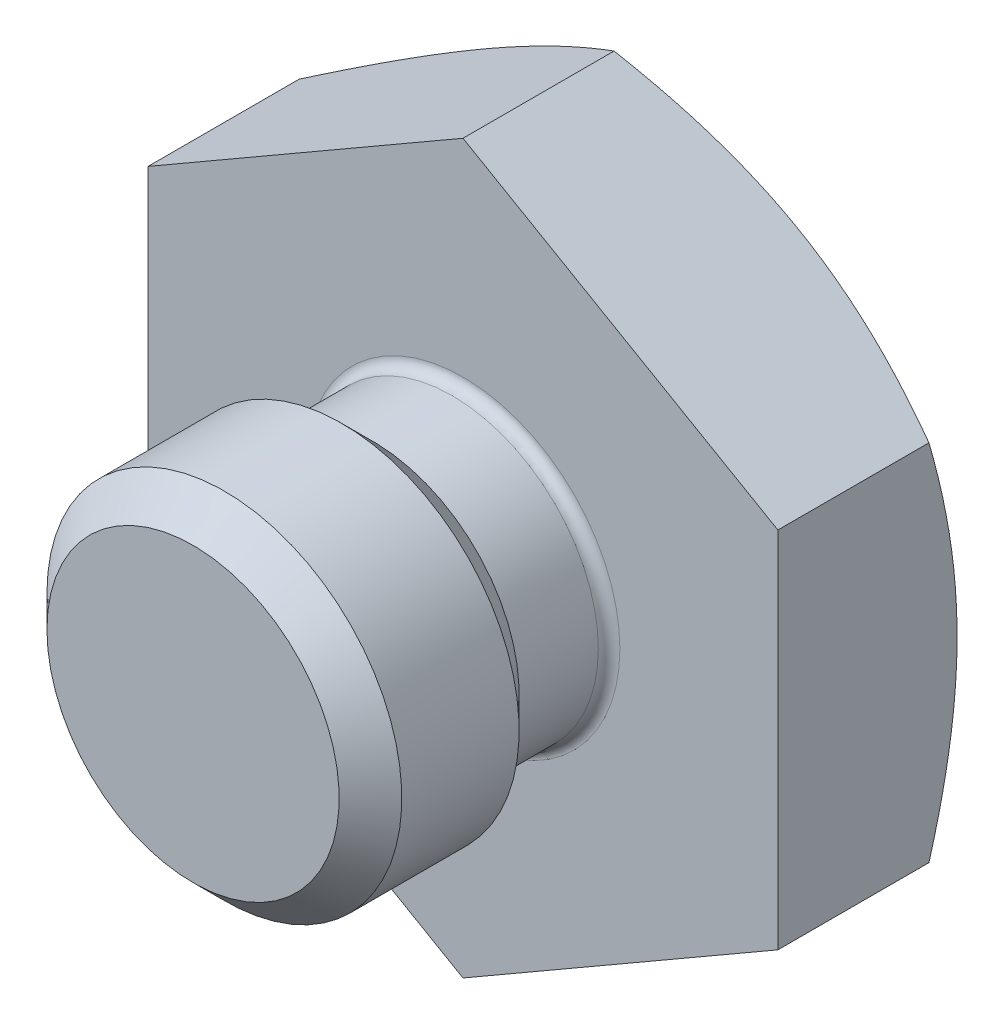
ISO-10303-21;
HEADER;
FILE_DESCRIPTION(('STEP AP214'),'2;1');
FILE_NAME('part.step','',(''),(''),'','','');
FILE_SCHEMA(('AUTOMOTIVE_DESIGN { 1 0 10303 214 1 1 1 1 }'));
ENDSEC;
DATA;
#1=APPLICATION_CONTEXT('core data for automotive mechanical design processes');
#2=APPLICATION_PROTOCOL_DEFINITION('international standard','automotive_design',2000,#1);
#3=PRODUCT_CONTEXT('',#1,'mechanical');
#4=PRODUCT('Part','Part','',(#3));
#5=PRODUCT_RELATED_PRODUCT_CATEGORY('part','',(#4));
#6=PRODUCT_DEFINITION_FORMATION('','',#4);
#7=PRODUCT_DEFINITION_CONTEXT('part definition',#1,'design');
#8=PRODUCT_DEFINITION('design','',#6,#7);
#9=PRODUCT_DEFINITION_SHAPE('','',#8);
#10=(LENGTH_UNIT() NAMED_UNIT(*) SI_UNIT(.MILLI.,.METRE.));
#11=(NAMED_UNIT(*) PLANE_ANGLE_UNIT() SI_UNIT($,.RADIAN.));
#12=(NAMED_UNIT(*) SI_UNIT($,.STERADIAN.) SOLID_ANGLE_UNIT());
#13=UNCERTAINTY_MEASURE_WITH_UNIT(LENGTH_MEASURE(1.E-05),#10,'distance_accuracy_value','');
#14=(GEOMETRIC_REPRESENTATION_CONTEXT(3) GLOBAL_UNCERTAINTY_ASSIGNED_CONTEXT((#13)) GLOBAL_UNIT_ASSIGNED_CONTEXT((#10,
#11,#12)) REPRESENTATION_CONTEXT('',''));
#15=CARTESIAN_POINT('',(0.,0.,0.));
#16=DIRECTION('',(0.,0.,1.));
#17=DIRECTION('',(1.,0.,0.));
#18=AXIS2_PLACEMENT_3D('',#15,#16,#17);
#19=CARTESIAN_POINT('',(0.,22.0651043510024,0.));
#20=DIRECTION('',(0.,0.,1.));
#21=DIRECTION('',(1.,0.,0.));
#22=AXIS2_PLACEMENT_3D('',#19,#20,#21);
#23=PLANE('',#22);
#24=CARTESIAN_POINT('',(0.,0.,0.));
#25=DIRECTION('',(0.,0.,1.));
#26=DIRECTION('',(1.,0.,0.));
#27=AXIS2_PLACEMENT_3D('',#24,#25,#26);
#28=CIRCLE('',#27,5.5372);
#29=CARTESIAN_POINT('',(5.5372,0.,0.));
#30=VERTEX_POINT('',#29);
#31=EDGE_CURVE('E42',#30,#30,#28,.F.);
#32=ORIENTED_EDGE('',*,*,#31,.T.);
#33=EDGE_LOOP('',(#32));
#34=FACE_BOUND('',#33,.T.);
#35=DIRECTION('',(0.,1.,0.));
#36=VECTOR('',#35,1.);
#37=CARTESIAN_POINT('',(11.1125,-6.41580486636972,0.));
#38=LINE('',#37,#36);
#39=CARTESIAN_POINT('',(11.1125,-6.41580486636972,0.));
#40=VERTEX_POINT('',#39);
#41=CARTESIAN_POINT('',(11.1125,6.41580486636972,0.));
#42=VERTEX_POINT('',#41);
#43=EDGE_CURVE('E115',#40,#42,#38,.T.);
#44=ORIENTED_EDGE('',*,*,#43,.T.);
#45=DIRECTION('',(-0.866025403784439,0.5,0.));
#46=VECTOR('',#45,1.);
#47=CARTESIAN_POINT('',(11.1125,6.41580486636972,0.));
#48=LINE('',#47,#46);
#49=CARTESIAN_POINT('',(0.,12.8316097327394,0.));
#50=VERTEX_POINT('',#49);
#51=EDGE_CURVE('E110',#42,#50,#48,.T.);
#52=ORIENTED_EDGE('',*,*,#51,.T.);
#53=DIRECTION('',(-0.866025403784439,-0.5,0.));
#54=VECTOR('',#53,1.);
#55=CARTESIAN_POINT('',(0.,12.8316097327394,0.));
#56=LINE('',#55,#54);
#57=CARTESIAN_POINT('',(-11.1125,6.41580486636972,0.));
#58=VERTEX_POINT('',#57);
#59=EDGE_CURVE('E108',#50,#58,#56,.T.);
#60=ORIENTED_EDGE('',*,*,#59,.T.);
#61=DIRECTION('',(0.,-1.,0.));
#62=VECTOR('',#61,1.);
#63=CARTESIAN_POINT('',(-11.1125,6.41580486636972,0.));
#64=LINE('',#63,#62);
#65=CARTESIAN_POINT('',(-11.1125,-6.41580486636972,0.));
#66=VERTEX_POINT('',#65);
#67=EDGE_CURVE('E57',#58,#66,#64,.T.);
#68=ORIENTED_EDGE('',*,*,#67,.T.);
#69=DIRECTION('',(0.866025403784439,-0.5,0.));
#70=VECTOR('',#69,1.);
#71=CARTESIAN_POINT('',(-11.1125,-6.41580486636972,0.));
#72=LINE('',#71,#70);
#73=CARTESIAN_POINT('',(0.,-12.8316097327394,0.));
#74=VERTEX_POINT('',#73);
#75=EDGE_CURVE('E97',#66,#74,#72,.T.);
#76=ORIENTED_EDGE('',*,*,#75,.T.);
#77=DIRECTION('',(0.866025403784439,0.5,0.));
#78=VECTOR('',#77,1.);
#79=CARTESIAN_POINT('',(0.,-12.8316097327394,0.));
#80=LINE('',#79,#78);
#81=EDGE_CURVE('E103',#74,#40,#80,.T.);
#82=ORIENTED_EDGE('',*,*,#81,.T.);
#83=EDGE_LOOP('',(#44,#52,#60,#68,#76,#82));
#84=FACE_BOUND('',#83,.T.);
#85=ADVANCED_FACE('F34',(#34,#84),#23,.T.);
#86=CARTESIAN_POINT('',(0.,0.,0.));
#87=DIRECTION('',(0.,0.,-1.));
#88=DIRECTION('',(-1.,0.,0.));
#89=AXIS2_PLACEMENT_3D('',#86,#87,#88);
#90=CYLINDRICAL_SURFACE('',#89,5.1562);
#91=CARTESIAN_POINT('',(0.,0.,0.380999999999999));
#92=DIRECTION('',(0.,0.,1.));
#93=DIRECTION('',(1.,0.,0.));
#94=AXIS2_PLACEMENT_3D('',#91,#92,#93);
#95=CIRCLE('',#94,5.1562);
#96=CARTESIAN_POINT('',(5.1562,0.,0.380999999999999));
#97=VERTEX_POINT('',#96);
#98=EDGE_CURVE('E12',#97,#97,#95,.T.);
#99=ORIENTED_EDGE('',*,*,#98,.T.);
#100=EDGE_LOOP('',(#99));
#101=FACE_BOUND('',#100,.T.);
#102=CARTESIAN_POINT('',(0.,0.,3.175));
#103=DIRECTION('',(0.,0.,-1.));
#104=DIRECTION('',(-1.,0.,0.));
#105=AXIS2_PLACEMENT_3D('',#102,#103,#104);
#106=CIRCLE('',#105,5.1562);
#107=CARTESIAN_POINT('',(-5.1562,0.,3.175));
#108=VERTEX_POINT('',#107);
#109=EDGE_CURVE('E180',#108,#108,#106,.T.);
#110=ORIENTED_EDGE('',*,*,#109,.T.);
#111=EDGE_LOOP('',(#110));
#112=FACE_BOUND('',#111,.T.);
#113=ADVANCED_FACE('F194',(#101,#112),#90,.T.);
#114=CARTESIAN_POINT('',(0.,0.,3.175));
#115=DIRECTION('',(0.,0.,1.));
#116=DIRECTION('',(1.,0.,0.));
#117=AXIS2_PLACEMENT_3D('',#114,#115,#116);
#118=CONICAL_SURFACE('',#117,5.1562,0.785398163397446);
#119=CARTESIAN_POINT('',(0.,0.,4.2799));
#120=DIRECTION('',(0.,0.,-1.));
#121=DIRECTION('',(-1.,0.,0.));
#122=AXIS2_PLACEMENT_3D('',#119,#120,#121);
#123=CIRCLE('',#122,6.2611);
#124=CARTESIAN_POINT('',(-6.2611,0.,4.2799));
#125=VERTEX_POINT('',#124);
#126=EDGE_CURVE('E177',#125,#125,#123,.T.);
#127=ORIENTED_EDGE('',*,*,#126,.T.);
#128=EDGE_LOOP('',(#127));
#129=FACE_BOUND('',#128,.T.);
#130=ORIENTED_EDGE('',*,*,#109,.F.);
#131=EDGE_LOOP('',(#130));
#132=FACE_BOUND('',#131,.T.);
#133=ADVANCED_FACE('F198',(#129,#132),#118,.T.);
#134=CARTESIAN_POINT('',(0.,0.,0.));
#135=DIRECTION('',(0.,0.,-1.));
#136=DIRECTION('',(-1.,0.,0.));
#137=AXIS2_PLACEMENT_3D('',#134,#135,#136);
#138=CYLINDRICAL_SURFACE('',#137,6.2611);
#139=CARTESIAN_POINT('',(0.,0.,8.42010000000001));
#140=DIRECTION('',(0.,0.,-1.));
#141=DIRECTION('',(-1.,0.,0.));
#142=AXIS2_PLACEMENT_3D('',#139,#140,#141);
#143=CIRCLE('',#142,6.2611);
#144=CARTESIAN_POINT('',(-6.2611,0.,8.42010000000001));
#145=VERTEX_POINT('',#144);
#146=EDGE_CURVE('E174',#145,#145,#143,.T.);
#147=ORIENTED_EDGE('',*,*,#146,.T.);
#148=EDGE_LOOP('',(#147));
#149=FACE_BOUND('',#148,.T.);
#150=ORIENTED_EDGE('',*,*,#126,.F.);
#151=EDGE_LOOP('',(#150));
#152=FACE_BOUND('',#151,.T.);
#153=ADVANCED_FACE('F204',(#149,#152),#138,.T.);
#154=CARTESIAN_POINT('',(0.,0.,8.42010000000001));
#155=DIRECTION('',(0.,0.,-1.));
#156=DIRECTION('',(-1.,0.,0.));
#157=AXIS2_PLACEMENT_3D('',#154,#155,#156);
#158=CONICAL_SURFACE('',#157,6.2611,0.785398163397451);
#159=CARTESIAN_POINT('',(0.,0.,9.525));
#160=DIRECTION('',(0.,0.,-1.));
#161=DIRECTION('',(-1.,0.,0.));
#162=AXIS2_PLACEMENT_3D('',#159,#160,#161);
#163=CIRCLE('',#162,5.1562);
#164=CARTESIAN_POINT('',(-5.1562,0.,9.525));
#165=VERTEX_POINT('',#164);
#166=EDGE_CURVE('E171',#165,#165,#163,.T.);
#167=ORIENTED_EDGE('',*,*,#166,.T.);
#168=EDGE_LOOP('',(#167));
#169=FACE_BOUND('',#168,.T.);
#170=ORIENTED_EDGE('',*,*,#146,.F.);
#171=EDGE_LOOP('',(#170));
#172=FACE_BOUND('',#171,.T.);
#173=ADVANCED_FACE('F208',(#169,#172),#158,.T.);
#174=CARTESIAN_POINT('',(0.,5.1562,9.525));
#175=DIRECTION('',(0.,0.,1.));
#176=DIRECTION('',(1.,0.,0.));
#177=AXIS2_PLACEMENT_3D('',#174,#175,#176);
#178=PLANE('',#177);
#179=ORIENTED_EDGE('',*,*,#166,.F.);
#180=EDGE_LOOP('',(#179));
#181=FACE_BOUND('',#180,.T.);
#182=ADVANCED_FACE('F151',(#181),#178,.T.);
#183=CARTESIAN_POINT('',(11.1125,6.41580486636972,-12.7));
#184=DIRECTION('',(0.5,0.866025403784439,0.));
#185=DIRECTION('',(-0.866025403784439,0.5,0.));
#186=AXIS2_PLACEMENT_3D('',#183,#184,#185);
#187=PLANE('',#186);
#188=DIRECTION('',(0.,0.,1.));
#189=VECTOR('',#188,1.);
#190=CARTESIAN_POINT('',(0.,12.8316097327394,-12.7));
#191=LINE('',#190,#189);
#192=CARTESIAN_POINT('',(0.,12.8316097327394,-5.33096060341504));
#193=VERTEX_POINT('',#192);
#194=EDGE_CURVE('E49',#193,#50,#191,.T.);
#195=ORIENTED_EDGE('',*,*,#194,.T.);
#196=ORIENTED_EDGE('',*,*,#51,.F.);
#197=DIRECTION('',(0.,0.,1.));
#198=VECTOR('',#197,1.);
#199=CARTESIAN_POINT('',(11.1125,6.41580486636972,-12.7));
#200=LINE('',#199,#198);
#201=CARTESIAN_POINT('',(11.1125,6.41580486636972,-5.33096060341504));
#202=VERTEX_POINT('',#201);
#203=EDGE_CURVE('E117',#202,#42,#200,.T.);
#204=ORIENTED_EDGE('',*,*,#203,.F.);
#205=CARTESIAN_POINT('',(-0.000199999999999041,12.8317252027933,-5.33089393584849));
#206=CARTESIAN_POINT('',(0.244076762021835,12.6906919484832,-5.41230598639815));
#207=CARTESIAN_POINT('',(0.489264313393952,12.5491328496966,-5.49002297782529));
#208=CARTESIAN_POINT('',(0.981605635632657,12.2648794547689,-5.63704157481002));
#209=CARTESIAN_POINT('',(1.22876002486926,12.1221848016117,-5.70634041256519));
#210=CARTESIAN_POINT('',(1.97420558123972,11.691801608975,-5.90026858248958));
#211=CARTESIAN_POINT('',(2.47543949233606,11.4024140754766,-6.01057385305758));
#212=CARTESIAN_POINT('',(3.22551305858847,10.9693589000887,-6.13991679700567));
#213=CARTESIAN_POINT('',(3.47211185206991,10.8269850202904,-6.17676168676763));
#214=CARTESIAN_POINT('',(3.96645121493752,10.5415780560677,-6.23854803187426));
#215=CARTESIAN_POINT('',(4.21419180620731,10.3985449590089,-6.26348925810822));
#216=CARTESIAN_POINT('',(4.71008602486758,10.1122402983758,-6.30082942022814));
#217=CARTESIAN_POINT('',(4.95823880876392,9.96896922179313,-6.31324326050465));
#218=CARTESIAN_POINT('',(5.45477431983529,9.68229431081387,-6.32526412462837));
#219=CARTESIAN_POINT('',(5.70315703966859,9.53889048065606,-6.32487154417028));
#220=CARTESIAN_POINT('',(6.16750984478556,9.27079626362282,-6.31217328038341));
#221=CARTESIAN_POINT('',(6.3835130443655,9.14608675819952,-6.30141650643445));
#222=CARTESIAN_POINT('',(6.81502263931866,8.89695457739541,-6.27042009971527));
#223=CARTESIAN_POINT('',(7.03052899846601,8.77253192292961,-6.25017979616281));
#224=CARTESIAN_POINT('',(7.46092779430608,8.52404106229246,-6.20056920621003));
#225=CARTESIAN_POINT('',(7.67581957542821,8.39997323461496,-6.171191378792));
#226=CARTESIAN_POINT('',(8.10459567090841,8.15241924046738,-6.10382119618171));
#227=CARTESIAN_POINT('',(8.31847991577917,8.02893311411583,-6.0658282554544));
#228=CARTESIAN_POINT('',(8.96773759978886,7.6540840154794,-5.93796633362871));
#229=CARTESIAN_POINT('',(9.40123086045864,7.40380656473982,-5.8353480010402));
#230=CARTESIAN_POINT('',(10.2617533370355,6.90698368124445,-5.60244613814769));
#231=CARTESIAN_POINT('',(10.6887935711641,6.66043188711547,-5.47221730835082));
#232=CARTESIAN_POINT('',(11.1127,6.41568939631588,-5.33089393584849));
#233=B_SPLINE_CURVE_WITH_KNOTS('',3,(#205,#206,#207,#208,#209,#210,#211,#212,#213,#214,#215,
#216,#217,#218,#219,#220,#221,#222,#223,#224,#225,#226,#227,#228,#229,#230,#231,#232),
.UNSPECIFIED.,.F.,.F.,(4,2,2,2,2,2,2,2,2,2,2,2,2,4),(0.,0.880670721261017,1.76163021875584,
3.52729939564295,4.38846390154098,5.24964498166892,6.10980026395483,6.96992896905975,
7.71870115413392,8.46752630882554,9.21697110123334,9.96646684570254,11.4984186964915,
13.0273634187077),.UNSPECIFIED.);
#234=EDGE_CURVE('E155',#193,#202,#233,.T.);
#235=ORIENTED_EDGE('',*,*,#234,.F.);
#236=EDGE_LOOP('',(#195,#196,#204,#235));
#237=FACE_BOUND('',#236,.T.);
#238=ADVANCED_FACE('F146',(#237),#187,.T.);
#239=CARTESIAN_POINT('',(11.1125,-6.41580486636972,-12.7));
#240=DIRECTION('',(1.,0.,0.));
#241=DIRECTION('',(0.,0.,-1.));
#242=AXIS2_PLACEMENT_3D('',#239,#240,#241);
#243=PLANE('',#242);
#244=ORIENTED_EDGE('',*,*,#203,.T.);
#245=ORIENTED_EDGE('',*,*,#43,.F.);
#246=DIRECTION('',(0.,0.,1.));
#247=VECTOR('',#246,1.);
#248=CARTESIAN_POINT('',(11.1125,-6.41580486636972,-12.7));
#249=LINE('',#248,#247);
#250=CARTESIAN_POINT('',(11.1125,-6.41580486636972,-5.33096060341504));
#251=VERTEX_POINT('',#250);
#252=EDGE_CURVE('E120',#251,#40,#249,.T.);
#253=ORIENTED_EDGE('',*,*,#252,.F.);
#254=CARTESIAN_POINT('',(11.1125,-17.3163808550814,-0.86011464174898));
#255=CARTESIAN_POINT('',(11.1125,-17.0732831474879,-0.978234188057745));
#256=CARTESIAN_POINT('',(11.1125,-16.8299023133235,-1.09577076662881));
#257=CARTESIAN_POINT('',(11.1125,-16.3425153146138,-1.32954607156344));
#258=CARTESIAN_POINT('',(11.1125,-16.0985091439224,-1.44578478511017));
#259=CARTESIAN_POINT('',(11.1125,-15.3654000608585,-1.79238640754345));
#260=CARTESIAN_POINT('',(11.1125,-14.8752773335228,-2.0206003247272));
#261=CARTESIAN_POINT('',(11.1125,-13.8891520054796,-2.47114232554079));
#262=CARTESIAN_POINT('',(11.1125,-13.3931319727371,-2.69343234514444));
#263=CARTESIAN_POINT('',(11.1125,-12.3971742596451,-3.12902399514797));
#264=CARTESIAN_POINT('',(11.1125,-11.8972367636722,-3.34232604559143));
#265=CARTESIAN_POINT('',(11.1125,-10.8765224111345,-3.76423055937271));
#266=CARTESIAN_POINT('',(11.1125,-10.3555916363179,-3.97246256598276));
#267=CARTESIAN_POINT('',(11.1125,-9.30766357441253,-4.37336691443061));
#268=CARTESIAN_POINT('',(11.1125,-8.78066561909573,-4.566037523266));
#269=CARTESIAN_POINT('',(11.1125,-7.72073996957428,-4.9308210859016));
#270=CARTESIAN_POINT('',(11.1125,-7.18782643720066,-5.10297486193236));
#271=CARTESIAN_POINT('',(11.1125,-6.11430720962286,-5.42126710583382));
#272=CARTESIAN_POINT('',(11.1125,-5.57370396599905,-5.56741367291428));
#273=CARTESIAN_POINT('',(11.1125,-4.7583463695225,-5.76150299576198));
#274=CARTESIAN_POINT('',(11.1125,-4.48653579470749,-5.82188548215318));
#275=CARTESIAN_POINT('',(11.1125,-3.94104211388288,-5.93355048898954));
#276=CARTESIAN_POINT('',(11.1125,-3.66735904567324,-5.98483319257206));
#277=CARTESIAN_POINT('',(11.1125,-3.11830510525835,-6.0773982101618));
#278=CARTESIAN_POINT('',(11.1125,-2.84293427353903,-6.11868076309662));
#279=CARTESIAN_POINT('',(11.1125,-2.29078777789797,-6.19042563364328));
#280=CARTESIAN_POINT('',(11.1125,-2.01401216977862,-6.2208883776943));
#281=CARTESIAN_POINT('',(11.1125,-1.4630936010086,-6.27000177646034));
#282=CARTESIAN_POINT('',(11.1125,-1.18896415966425,-6.28880314853497));
#283=CARTESIAN_POINT('',(11.1125,-0.640156165528436,-6.31479208853917));
#284=CARTESIAN_POINT('',(11.1125,-0.36547762206685,-6.32197985214618));
#285=CARTESIAN_POINT('',(11.1125,0.183942547843022,-6.3245702514621));
#286=CARTESIAN_POINT('',(11.1125,0.45868417542157,-6.31997265632487));
#287=CARTESIAN_POINT('',(11.1125,1.00772685757231,-6.29910529502289));
#288=CARTESIAN_POINT('',(11.1125,1.28202789053898,-6.28283497297929));
#289=CARTESIAN_POINT('',(11.1125,1.93850005283681,-6.23027423297106));
#290=CARTESIAN_POINT('',(11.1125,2.32024937636801,-6.18859928722155));
#291=CARTESIAN_POINT('',(11.1125,3.08095305469322,-6.08489345026863));
#292=CARTESIAN_POINT('',(11.1125,3.4599070350272,-6.02285988072812));
#293=CARTESIAN_POINT('',(11.1125,4.59209625060347,-5.80950844564311));
#294=CARTESIAN_POINT('',(11.1125,5.34027287668224,-5.63097486906531));
#295=CARTESIAN_POINT('',(11.1125,6.45963309143137,-5.32076231528335));
#296=CARTESIAN_POINT('',(11.1125,6.83659788523786,-5.20874134917319));
#297=CARTESIAN_POINT('',(11.1125,7.58686493407525,-4.97293066199331));
#298=CARTESIAN_POINT('',(11.1125,7.96016716004741,-4.84914084763294));
#299=CARTESIAN_POINT('',(11.1125,8.7032315769044,-4.59178840133819));
#300=CARTESIAN_POINT('',(11.1125,9.07299478553518,-4.45822868072591));
#301=CARTESIAN_POINT('',(11.1125,9.80944455189089,-4.18292925909557));
#302=CARTESIAN_POINT('',(11.1125,10.1761311917065,-4.04118977713451));
#303=CARTESIAN_POINT('',(11.1125,10.8770185909319,-3.76269608550133));
#304=CARTESIAN_POINT('',(11.1125,11.2114324984845,-3.62647626593185));
#305=CARTESIAN_POINT('',(11.1125,11.8782166722031,-3.3491161399066));
#306=CARTESIAN_POINT('',(11.1125,12.2105868978992,-3.20797573637798));
#307=CARTESIAN_POINT('',(11.1125,13.2050473108193,-2.77825367654655));
#308=CARTESIAN_POINT('',(11.1125,13.8644262156387,-2.48339572995478));
#309=CARTESIAN_POINT('',(11.1125,15.177772334415,-1.88121634572846));
#310=CARTESIAN_POINT('',(11.1125,15.8317370865141,-1.57388957695138));
#311=CARTESIAN_POINT('',(11.1125,17.1351542325189,-0.949912679069006));
#312=CARTESIAN_POINT('',(11.1125,17.7846068420358,-0.633262999296053));
#313=CARTESIAN_POINT('',(11.1125,19.0810712253211,0.00776912803546464));
#314=CARTESIAN_POINT('',(11.1125,19.7280768479566,0.332163983963949));
#315=CARTESIAN_POINT('',(11.1125,21.0192312519957,0.986597155662237));
#316=CARTESIAN_POINT('',(11.1125,21.6633800047825,1.31663552780229));
#317=CARTESIAN_POINT('',(11.1125,22.9491994310014,1.98111449897096));
#318=CARTESIAN_POINT('',(11.1125,23.5908706745962,2.31555399605806));
#319=CARTESIAN_POINT('',(11.1125,24.8723088530475,2.98805209019673));
#320=CARTESIAN_POINT('',(11.1125,25.5120757949708,3.32611067379645));
#321=CARTESIAN_POINT('',(11.1125,27.2834661272415,4.26735362520282));
#322=CARTESIAN_POINT('',(11.1125,28.4134154794286,4.87368769134571));
#323=CARTESIAN_POINT('',(11.1125,30.669809329253,6.09301713013968));
#324=CARTESIAN_POINT('',(11.1125,31.796253574387,6.70601296903109));
#325=CARTESIAN_POINT('',(11.1125,34.0425334369422,7.93478972391058));
#326=CARTESIAN_POINT('',(11.1125,35.1623784136073,8.55055354090201));
#327=CARTESIAN_POINT('',(11.1125,36.8405520575841,9.47697092510659));
#328=CARTESIAN_POINT('',(11.1125,37.3996539726158,9.78622549701891));
#329=CARTESIAN_POINT('',(11.1125,38.5173987127941,10.4055618320855));
#330=CARTESIAN_POINT('',(11.1125,39.076041538431,10.7156435943547));
#331=CARTESIAN_POINT('',(11.1125,39.634483563383,11.0260866520133));
#332=B_SPLINE_CURVE_WITH_KNOTS('',3,(#254,#255,#256,#257,#258,#259,#260,#261,#262,#263,#264,
#265,#266,#267,#268,#269,#270,#271,#272,#273,#274,#275,#276,#277,#278,#279,#280,#281,#282,#283,
#284,#285,#286,#287,#288,#289,#290,#291,#292,#293,#294,#295,#296,#297,#298,#299,#300,#301,#302,
#303,#304,#305,#306,#307,#308,#309,#310,#311,#312,#313,#314,#315,#316,#317,#318,#319,#320,#321,
#322,#323,#324,#325,#326,#327,#328,#329,#330,#331),.UNSPECIFIED.,.F.,.F.,(4,2,2,2,2,2,2,2,2,2,2,
2,2,2,2,2,2,2,2,2,2,2,2,2,2,2,2,2,2,2,2,2,2,2,2,2,2,2,4),(0.,0.81082437207601,1.6216567442356,
3.24355759731365,4.87414394743095,6.50465400904547,8.18748672449527,9.87050659173409,
11.5501197862313,13.2292089938113,14.0643916151135,14.8995574260695,15.7347032809421,
16.5698162167092,17.3938976494854,18.217965197185,19.0420488864608,19.8661718228729,
21.0175759114424,22.1691315370382,24.4733999702539,25.6530704591724,26.8327503000172,
28.0120800304364,29.1913781926162,30.2746142941394,31.3578717777545,33.52458400612,
35.6922325988175,37.8597768887595,40.0310639716323,42.2023727550863,44.3731478622347,
46.5439149035868,50.3909357462108,54.23822758843,58.0721399664524,59.988933682426,
61.9057253480588),.UNSPECIFIED.);
#333=EDGE_CURVE('E163',#202,#251,#332,.F.);
#334=ORIENTED_EDGE('',*,*,#333,.F.);
#335=EDGE_LOOP('',(#244,#245,#253,#334));
#336=FACE_BOUND('',#335,.T.);
#337=ADVANCED_FACE('F150',(#336),#243,.T.);
#338=CARTESIAN_POINT('',(0.,-12.8316097327394,-12.7));
#339=DIRECTION('',(0.5,-0.866025403784439,0.));
#340=DIRECTION('',(0.866025403784439,0.5,0.));
#341=AXIS2_PLACEMENT_3D('',#338,#339,#340);
#342=PLANE('',#341);
#343=ORIENTED_EDGE('',*,*,#252,.T.);
#344=ORIENTED_EDGE('',*,*,#81,.F.);
#345=DIRECTION('',(0.,0.,1.));
#346=VECTOR('',#345,1.);
#347=CARTESIAN_POINT('',(0.,-12.8316097327394,-12.7));
#348=LINE('',#347,#346);
#349=CARTESIAN_POINT('',(0.,-12.8316097327394,-5.33096060341504));
#350=VERTEX_POINT('',#349);
#351=EDGE_CURVE('E93',#350,#74,#348,.T.);
#352=ORIENTED_EDGE('',*,*,#351,.F.);
#353=CARTESIAN_POINT('',(11.1127,-6.41568939631589,-5.33089393584849));
#354=CARTESIAN_POINT('',(10.8684232379782,-6.55672265062596,-5.41230598639814));
#355=CARTESIAN_POINT('',(10.623235686606,-6.6982817494126,-5.49002297782529));
#356=CARTESIAN_POINT('',(10.1308943643673,-6.98253514434029,-5.63704157481002));
#357=CARTESIAN_POINT('',(9.88373997513074,-7.12522979749744,-5.70634041256518));
#358=CARTESIAN_POINT('',(9.13829441876028,-7.55561299013413,-5.90026858248958));
#359=CARTESIAN_POINT('',(8.63706050766394,-7.84500052363258,-6.01057385305757));
#360=CARTESIAN_POINT('',(7.88698694141154,-8.27805569902043,-6.13991679700566));
#361=CARTESIAN_POINT('',(7.64038814793009,-8.42042957881877,-6.17676168676762));
#362=CARTESIAN_POINT('',(7.14604878506248,-8.70583654304142,-6.23854803187425));
#363=CARTESIAN_POINT('',(6.89830819379269,-8.84886964010023,-6.26348925810821));
#364=CARTESIAN_POINT('',(6.40241397513242,-9.13517430073331,-6.30082942022814));
#365=CARTESIAN_POINT('',(6.15426119123608,-9.27844537731602,-6.31324326050465));
#366=CARTESIAN_POINT('',(5.65772568016471,-9.56512028829528,-6.32526412462837));
#367=CARTESIAN_POINT('',(5.40934296033141,-9.70852411845309,-6.32487154417027));
#368=CARTESIAN_POINT('',(4.94499015521444,-9.97661833548633,-6.31217328038341));
#369=CARTESIAN_POINT('',(4.7289869556345,-10.1013278409096,-6.30141650643444));
#370=CARTESIAN_POINT('',(4.29747736068134,-10.3504600217137,-6.27042009971527));
#371=CARTESIAN_POINT('',(4.08197100153399,-10.4748826761795,-6.25017979616281));
#372=CARTESIAN_POINT('',(3.65157220569392,-10.7233735368167,-6.20056920621003));
#373=CARTESIAN_POINT('',(3.43668042457179,-10.8474413644942,-6.171191378792));
#374=CARTESIAN_POINT('',(3.00790432909158,-11.0949953586418,-6.1038211961817));
#375=CARTESIAN_POINT('',(2.79402008422083,-11.2184814849933,-6.0658282554544));
#376=CARTESIAN_POINT('',(2.14476240021114,-11.5933305836297,-5.93796633362871));
#377=CARTESIAN_POINT('',(1.71126913954136,-11.8436080343693,-5.8353480010402));
#378=CARTESIAN_POINT('',(0.850746662964499,-12.3404309178647,-5.60244613814769));
#379=CARTESIAN_POINT('',(0.423706428835852,-12.5869827119937,-5.47221730835082));
#380=CARTESIAN_POINT('',(-0.000199999999999809,-12.8317252027933,-5.33089393584849));
#381=B_SPLINE_CURVE_WITH_KNOTS('',3,(#353,#354,#355,#356,#357,#358,#359,#360,#361,#362,#363,
#364,#365,#366,#367,#368,#369,#370,#371,#372,#373,#374,#375,#376,#377,#378,#379,#380),
.UNSPECIFIED.,.F.,.F.,(4,2,2,2,2,2,2,2,2,2,2,2,2,4),(0.,0.880670721261018,1.76163021875584,
3.52729939564295,4.38846390154098,5.24964498166892,6.10980026395483,6.96992896905975,
7.71870115413393,8.46752630882554,9.21697110123335,9.96646684570254,11.4984186964915,
13.0273634187077),.UNSPECIFIED.);
#382=EDGE_CURVE('E326',#251,#350,#381,.T.);
#383=ORIENTED_EDGE('',*,*,#382,.F.);
#384=EDGE_LOOP('',(#343,#344,#352,#383));
#385=FACE_BOUND('',#384,.T.);
#386=ADVANCED_FACE('F237',(#385),#342,.T.);
#387=CARTESIAN_POINT('',(-11.1125,-6.41580486636972,-12.7));
#388=DIRECTION('',(-0.5,-0.866025403784439,0.));
#389=DIRECTION('',(0.866025403784439,-0.5,0.));
#390=AXIS2_PLACEMENT_3D('',#387,#388,#389);
#391=PLANE('',#390);
#392=ORIENTED_EDGE('',*,*,#351,.T.);
#393=ORIENTED_EDGE('',*,*,#75,.F.);
#394=DIRECTION('',(0.,0.,1.));
#395=VECTOR('',#394,1.);
#396=CARTESIAN_POINT('',(-11.1125,-6.41580486636972,-12.7));
#397=LINE('',#396,#395);
#398=CARTESIAN_POINT('',(-11.1125,-6.41580486636972,-5.33096060341504));
#399=VERTEX_POINT('',#398);
#400=EDGE_CURVE('E86',#399,#66,#397,.T.);
#401=ORIENTED_EDGE('',*,*,#400,.F.);
#402=CARTESIAN_POINT('',(0.000200000000000615,-12.8317252027933,-5.33089393584849));
#403=CARTESIAN_POINT('',(-0.244076762021833,-12.6906919484832,-5.41230598639815));
#404=CARTESIAN_POINT('',(-0.48926431339395,-12.5491328496966,-5.49002297782529));
#405=CARTESIAN_POINT('',(-0.981605635632655,-12.2648794547689,-5.63704157481002));
#406=CARTESIAN_POINT('',(-1.22876002486926,-12.1221848016117,-5.70634041256518));
#407=CARTESIAN_POINT('',(-1.97420558123972,-11.691801608975,-5.90026858248958));
#408=CARTESIAN_POINT('',(-2.47543949233606,-11.4024140754766,-6.01057385305757));
#409=CARTESIAN_POINT('',(-3.22551305858847,-10.9693589000887,-6.13991679700567));
#410=CARTESIAN_POINT('',(-3.47211185206991,-10.8269850202904,-6.17676168676763));
#411=CARTESIAN_POINT('',(-3.96645121493752,-10.5415780560677,-6.23854803187426));
#412=CARTESIAN_POINT('',(-4.21419180620731,-10.3985449590089,-6.26348925810822));
#413=CARTESIAN_POINT('',(-4.71008602486758,-10.1122402983758,-6.30082942022814));
#414=CARTESIAN_POINT('',(-4.95823880876392,-9.96896922179313,-6.31324326050465));
#415=CARTESIAN_POINT('',(-5.45477431983529,-9.68229431081387,-6.32526412462837));
#416=CARTESIAN_POINT('',(-5.70315703966859,-9.53889048065606,-6.32487154417028));
#417=CARTESIAN_POINT('',(-6.16750984478556,-9.27079626362282,-6.31217328038341));
#418=CARTESIAN_POINT('',(-6.38351304436549,-9.14608675819953,-6.30141650643444));
#419=CARTESIAN_POINT('',(-6.81502263931866,-8.89695457739541,-6.27042009971527));
#420=CARTESIAN_POINT('',(-7.030528998466,-8.77253192292962,-6.25017979616281));
#421=CARTESIAN_POINT('',(-7.46092779430607,-8.52404106229246,-6.20056920621003));
#422=CARTESIAN_POINT('',(-7.67581957542821,-8.39997323461496,-6.171191378792));
#423=CARTESIAN_POINT('',(-8.10459567090841,-8.15241924046739,-6.10382119618171));
#424=CARTESIAN_POINT('',(-8.31847991577917,-8.02893311411584,-6.0658282554544));
#425=CARTESIAN_POINT('',(-8.96773759978886,-7.65408401547941,-5.93796633362871));
#426=CARTESIAN_POINT('',(-9.40123086045863,-7.40380656473982,-5.8353480010402));
#427=CARTESIAN_POINT('',(-10.2617533370355,-6.90698368124445,-5.60244613814769));
#428=CARTESIAN_POINT('',(-10.6887935711641,-6.66043188711547,-5.47221730835082));
#429=CARTESIAN_POINT('',(-11.1127,-6.41568939631588,-5.33089393584849));
#430=B_SPLINE_CURVE_WITH_KNOTS('',3,(#402,#403,#404,#405,#406,#407,#408,#409,#410,#411,#412,
#413,#414,#415,#416,#417,#418,#419,#420,#421,#422,#423,#424,#425,#426,#427,#428,#429),
.UNSPECIFIED.,.F.,.F.,(4,2,2,2,2,2,2,2,2,2,2,2,2,4),(0.,0.880670721261016,1.76163021875584,
3.52729939564295,4.38846390154097,5.24964498166892,6.10980026395483,6.96992896905975,
7.71870115413392,8.46752630882554,9.21697110123334,9.96646684570254,11.4984186964915,
13.0273634187077),.UNSPECIFIED.);
#431=EDGE_CURVE('E327',#350,#399,#430,.T.);
#432=ORIENTED_EDGE('',*,*,#431,.F.);
#433=EDGE_LOOP('',(#392,#393,#401,#432));
#434=FACE_BOUND('',#433,.T.);
#435=ADVANCED_FACE('F98',(#434),#391,.T.);
#436=CARTESIAN_POINT('',(-11.1125,6.41580486636972,-12.7));
#437=DIRECTION('',(-1.,0.,0.));
#438=DIRECTION('',(0.,0.,1.));
#439=AXIS2_PLACEMENT_3D('',#436,#437,#438);
#440=PLANE('',#439);
#441=ORIENTED_EDGE('',*,*,#400,.T.);
#442=ORIENTED_EDGE('',*,*,#67,.F.);
#443=DIRECTION('',(0.,0.,1.));
#444=VECTOR('',#443,1.);
#445=CARTESIAN_POINT('',(-11.1125,6.41580486636972,-12.7));
#446=LINE('',#445,#444);
#447=CARTESIAN_POINT('',(-11.1125,6.41580486636972,-5.33096060341504));
#448=VERTEX_POINT('',#447);
#449=EDGE_CURVE('E94',#448,#58,#446,.T.);
#450=ORIENTED_EDGE('',*,*,#449,.F.);
#451=CARTESIAN_POINT('',(-11.1125,-17.3163808550814,-0.860114641748983));
#452=CARTESIAN_POINT('',(-11.1125,-17.0732831474879,-0.97823418805775));
#453=CARTESIAN_POINT('',(-11.1125,-16.8299023133235,-1.09577076662882));
#454=CARTESIAN_POINT('',(-11.1125,-16.3425153146138,-1.32954607156345));
#455=CARTESIAN_POINT('',(-11.1125,-16.0985091439224,-1.44578478511017));
#456=CARTESIAN_POINT('',(-11.1125,-15.3654000608585,-1.79238640754345));
#457=CARTESIAN_POINT('',(-11.1125,-14.8752773335228,-2.02060032472721));
#458=CARTESIAN_POINT('',(-11.1125,-13.8891520054796,-2.47114232554079));
#459=CARTESIAN_POINT('',(-11.1125,-13.393131972737,-2.69343234514445));
#460=CARTESIAN_POINT('',(-11.1125,-12.3971742596451,-3.12902399514798));
#461=CARTESIAN_POINT('',(-11.1125,-11.8972367636722,-3.34232604559144));
#462=CARTESIAN_POINT('',(-11.1125,-10.8765224111345,-3.76423055937272));
#463=CARTESIAN_POINT('',(-11.1125,-10.3555916363179,-3.97246256598277));
#464=CARTESIAN_POINT('',(-11.1125,-9.30766357441252,-4.37336691443062));
#465=CARTESIAN_POINT('',(-11.1125,-8.78066561909572,-4.56603752326601));
#466=CARTESIAN_POINT('',(-11.1125,-7.72073996957427,-4.93082108590161));
#467=CARTESIAN_POINT('',(-11.1125,-7.18782643720066,-5.10297486193236));
#468=CARTESIAN_POINT('',(-11.1125,-6.11430720962285,-5.42126710583383));
#469=CARTESIAN_POINT('',(-11.1125,-5.57370396599905,-5.56741367291428));
#470=CARTESIAN_POINT('',(-11.1125,-4.75834636952249,-5.76150299576198));
#471=CARTESIAN_POINT('',(-11.1125,-4.48653579470748,-5.82188548215318));
#472=CARTESIAN_POINT('',(-11.1125,-3.94104211388287,-5.93355048898954));
#473=CARTESIAN_POINT('',(-11.1125,-3.66735904567323,-5.98483319257207));
#474=CARTESIAN_POINT('',(-11.1125,-3.11830510525835,-6.07739821016181));
#475=CARTESIAN_POINT('',(-11.1125,-2.84293427353903,-6.11868076309662));
#476=CARTESIAN_POINT('',(-11.1125,-2.29078777789796,-6.19042563364329));
#477=CARTESIAN_POINT('',(-11.1125,-2.01401216977861,-6.22088837769431));
#478=CARTESIAN_POINT('',(-11.1125,-1.46309360100859,-6.27000177646034));
#479=CARTESIAN_POINT('',(-11.1125,-1.18896415966425,-6.28880314853498));
#480=CARTESIAN_POINT('',(-11.1125,-0.640156165528431,-6.31479208853917));
#481=CARTESIAN_POINT('',(-11.1125,-0.365477622066847,-6.32197985214619));
#482=CARTESIAN_POINT('',(-11.1125,0.183942547843024,-6.3245702514621));
#483=CARTESIAN_POINT('',(-11.1125,0.458684175421572,-6.31997265632487));
#484=CARTESIAN_POINT('',(-11.1125,1.00772685757232,-6.29910529502289));
#485=CARTESIAN_POINT('',(-11.1125,1.28202789053898,-6.28283497297929));
#486=CARTESIAN_POINT('',(-11.1125,1.93850005283681,-6.23027423297106));
#487=CARTESIAN_POINT('',(-11.1125,2.32024937636801,-6.18859928722155));
#488=CARTESIAN_POINT('',(-11.1125,3.08095305469323,-6.08489345026863));
#489=CARTESIAN_POINT('',(-11.1125,3.45990703502721,-6.02285988072812));
#490=CARTESIAN_POINT('',(-11.1125,4.59209625060348,-5.80950844564311));
#491=CARTESIAN_POINT('',(-11.1125,5.34027287668224,-5.63097486906531));
#492=CARTESIAN_POINT('',(-11.1125,6.45963309143137,-5.32076231528335));
#493=CARTESIAN_POINT('',(-11.1125,6.83659788523786,-5.20874134917319));
#494=CARTESIAN_POINT('',(-11.1125,7.58686493407525,-4.97293066199331));
#495=CARTESIAN_POINT('',(-11.1125,7.96016716004741,-4.84914084763294));
#496=CARTESIAN_POINT('',(-11.1125,8.7032315769044,-4.5917884013382));
#497=CARTESIAN_POINT('',(-11.1125,9.07299478553518,-4.45822868072591));
#498=CARTESIAN_POINT('',(-11.1125,9.80944455189089,-4.18292925909557));
#499=CARTESIAN_POINT('',(-11.1125,10.1761311917065,-4.04118977713452));
#500=CARTESIAN_POINT('',(-11.1125,10.8770185909319,-3.76269608550133));
#501=CARTESIAN_POINT('',(-11.1125,11.2114324984845,-3.62647626593185));
#502=CARTESIAN_POINT('',(-11.1125,11.8782166722031,-3.3491161399066));
#503=CARTESIAN_POINT('',(-11.1125,12.2105868978992,-3.20797573637798));
#504=CARTESIAN_POINT('',(-11.1125,13.2050473108193,-2.77825367654655));
#505=CARTESIAN_POINT('',(-11.1125,13.8644262156387,-2.48339572995478));
#506=CARTESIAN_POINT('',(-11.1125,15.177772334415,-1.88121634572846));
#507=CARTESIAN_POINT('',(-11.1125,15.8317370865141,-1.57388957695138));
#508=CARTESIAN_POINT('',(-11.1125,17.1351542325189,-0.94991267906901));
#509=CARTESIAN_POINT('',(-11.1125,17.7846068420358,-0.633262999296054));
#510=CARTESIAN_POINT('',(-11.1125,19.0810712253211,0.00776912803546545));
#511=CARTESIAN_POINT('',(-11.1125,19.7280768479566,0.332163983963949));
#512=CARTESIAN_POINT('',(-11.1125,21.0192312519957,0.986597155662237));
#513=CARTESIAN_POINT('',(-11.1125,21.6633800047825,1.31663552780229));
#514=CARTESIAN_POINT('',(-11.1125,22.9491994310014,1.98111449897096));
#515=CARTESIAN_POINT('',(-11.1125,23.5908706745962,2.31555399605806));
#516=CARTESIAN_POINT('',(-11.1125,24.8723088530475,2.98805209019673));
#517=CARTESIAN_POINT('',(-11.1125,25.5120757949708,3.32611067379645));
#518=CARTESIAN_POINT('',(-11.1125,27.2834661272416,4.26735362520283));
#519=CARTESIAN_POINT('',(-11.1125,28.4134154794287,4.87368769134571));
#520=CARTESIAN_POINT('',(-11.1125,30.669809329253,6.09301713013968));
#521=CARTESIAN_POINT('',(-11.1125,31.796253574387,6.70601296903109));
#522=CARTESIAN_POINT('',(-11.1125,34.0425334369422,7.93478972391058));
#523=CARTESIAN_POINT('',(-11.1125,35.1623784136073,8.550553540902));
#524=CARTESIAN_POINT('',(-11.1125,36.8405520575841,9.47697092510658));
#525=CARTESIAN_POINT('',(-11.1125,37.3996539726158,9.7862254970189));
#526=CARTESIAN_POINT('',(-11.1125,38.5173987127941,10.4055618320855));
#527=CARTESIAN_POINT('',(-11.1125,39.076041538431,10.7156435943547));
#528=CARTESIAN_POINT('',(-11.1125,39.634483563383,11.0260866520133));
#529=B_SPLINE_CURVE_WITH_KNOTS('',3,(#451,#452,#453,#454,#455,#456,#457,#458,#459,#460,#461,
#462,#463,#464,#465,#466,#467,#468,#469,#470,#471,#472,#473,#474,#475,#476,#477,#478,#479,#480,
#481,#482,#483,#484,#485,#486,#487,#488,#489,#490,#491,#492,#493,#494,#495,#496,#497,#498,#499,
#500,#501,#502,#503,#504,#505,#506,#507,#508,#509,#510,#511,#512,#513,#514,#515,#516,#517,#518,
#519,#520,#521,#522,#523,#524,#525,#526,#527,#528),.UNSPECIFIED.,.F.,.F.,(4,2,2,2,2,2,2,2,2,2,2,
2,2,2,2,2,2,2,2,2,2,2,2,2,2,2,2,2,2,2,2,2,2,2,2,2,2,2,4),(0.,0.810824372076015,1.6216567442356,
3.24355759731365,4.87414394743096,6.50465400904548,8.18748672449527,9.8705065917341,
11.5501197862313,13.2292089938113,14.0643916151135,14.8995574260695,15.7347032809421,
16.5698162167092,17.3938976494854,18.2179651971851,19.0420488864608,19.8661718228729,
21.0175759114424,22.1691315370382,24.4733999702539,25.6530704591724,26.8327503000172,
28.0120800304364,29.1913781926162,30.2746142941394,31.3578717777545,33.52458400612,
35.6922325988175,37.8597768887595,40.0310639716323,42.2023727550863,44.3731478622347,
46.5439149035868,50.3909357462109,54.23822758843,58.0721399664524,59.9889336824259,
61.9057253480588),.UNSPECIFIED.);
#530=EDGE_CURVE('E90',#399,#448,#529,.T.);
#531=ORIENTED_EDGE('',*,*,#530,.F.);
#532=EDGE_LOOP('',(#441,#442,#450,#531));
#533=FACE_BOUND('',#532,.T.);
#534=ADVANCED_FACE('F88',(#533),#440,.T.);
#535=CARTESIAN_POINT('',(0.,12.8316097327394,-12.7));
#536=DIRECTION('',(-0.5,0.866025403784439,0.));
#537=DIRECTION('',(-0.866025403784439,-0.5,0.));
#538=AXIS2_PLACEMENT_3D('',#535,#536,#537);
#539=PLANE('',#538);
#540=ORIENTED_EDGE('',*,*,#449,.T.);
#541=ORIENTED_EDGE('',*,*,#59,.F.);
#542=ORIENTED_EDGE('',*,*,#194,.F.);
#543=CARTESIAN_POINT('',(-11.1127,6.41568939631588,-5.33089393584849));
#544=CARTESIAN_POINT('',(-10.8684232379782,6.55672265062596,-5.41230598639814));
#545=CARTESIAN_POINT('',(-10.623235686606,6.69828174941259,-5.49002297782529));
#546=CARTESIAN_POINT('',(-10.1308943643673,6.98253514434029,-5.63704157481002));
#547=CARTESIAN_POINT('',(-9.88373997513073,7.12522979749744,-5.70634041256519));
#548=CARTESIAN_POINT('',(-9.13829441876028,7.55561299013413,-5.90026858248958));
#549=CARTESIAN_POINT('',(-8.63706050766394,7.84500052363257,-6.01057385305757));
#550=CARTESIAN_POINT('',(-7.88698694141153,8.27805569902042,-6.13991679700567));
#551=CARTESIAN_POINT('',(-7.64038814793009,8.42042957881877,-6.17676168676763));
#552=CARTESIAN_POINT('',(-7.14604878506247,8.70583654304142,-6.23854803187426));
#553=CARTESIAN_POINT('',(-6.89830819379269,8.84886964010022,-6.26348925810822));
#554=CARTESIAN_POINT('',(-6.40241397513241,9.13517430073331,-6.30082942022814));
#555=CARTESIAN_POINT('',(-6.15426119123608,9.27844537731602,-6.31324326050465));
#556=CARTESIAN_POINT('',(-5.65772568016471,9.56512028829528,-6.32526412462837));
#557=CARTESIAN_POINT('',(-5.40934296033141,9.70852411845309,-6.32487154417028));
#558=CARTESIAN_POINT('',(-4.94499015521444,9.97661833548633,-6.31217328038341));
#559=CARTESIAN_POINT('',(-4.7289869556345,10.1013278409096,-6.30141650643444));
#560=CARTESIAN_POINT('',(-4.29747736068134,10.3504600217137,-6.27042009971527));
#561=CARTESIAN_POINT('',(-4.08197100153399,10.4748826761795,-6.25017979616281));
#562=CARTESIAN_POINT('',(-3.65157220569392,10.7233735368167,-6.20056920621003));
#563=CARTESIAN_POINT('',(-3.43668042457178,10.8474413644942,-6.171191378792));
#564=CARTESIAN_POINT('',(-3.00790432909158,11.0949953586418,-6.10382119618171));
#565=CARTESIAN_POINT('',(-2.79402008422083,11.2184814849933,-6.0658282554544));
#566=CARTESIAN_POINT('',(-2.14476240021114,11.5933305836297,-5.93796633362871));
#567=CARTESIAN_POINT('',(-1.71126913954136,11.8436080343693,-5.8353480010402));
#568=CARTESIAN_POINT('',(-0.8507466629645,12.3404309178647,-5.60244613814769));
#569=CARTESIAN_POINT('',(-0.423706428835853,12.5869827119937,-5.47221730835082));
#570=CARTESIAN_POINT('',(0.000199999999999267,12.8317252027933,-5.33089393584849));
#571=B_SPLINE_CURVE_WITH_KNOTS('',3,(#543,#544,#545,#546,#547,#548,#549,#550,#551,#552,#553,
#554,#555,#556,#557,#558,#559,#560,#561,#562,#563,#564,#565,#566,#567,#568,#569,#570),
.UNSPECIFIED.,.F.,.F.,(4,2,2,2,2,2,2,2,2,2,2,2,2,4),(0.,0.880670721261016,1.76163021875584,
3.52729939564295,4.38846390154098,5.24964498166892,6.10980026395483,6.96992896905975,
7.71870115413392,8.46752630882554,9.21697110123335,9.96646684570254,11.4984186964915,
13.0273634187077),.UNSPECIFIED.);
#572=EDGE_CURVE('E119',#448,#193,#571,.T.);
#573=ORIENTED_EDGE('',*,*,#572,.F.);
#574=EDGE_LOOP('',(#540,#541,#542,#573));
#575=FACE_BOUND('',#574,.T.);
#576=ADVANCED_FACE('F139',(#575),#539,.T.);
#577=CARTESIAN_POINT('',(0.,0.,-12.446));
#578=DIRECTION('',(0.,0.,-1.));
#579=DIRECTION('',(0.,-1.,0.));
#580=AXIS2_PLACEMENT_3D('',#577,#578,#579);
#581=SPHERICAL_SURFACE('',#580,0.254000000000003);
#582=CARTESIAN_POINT('',(0.,0.,-12.6659704525613));
#583=DIRECTION('',(0.,0.,-1.));
#584=DIRECTION('',(-1.,0.,0.));
#585=AXIS2_PLACEMENT_3D('',#582,#583,#584);
#586=CIRCLE('',#585,0.127);
#587=CARTESIAN_POINT('',(-0.127,0.,-12.6659704525613));
#588=VERTEX_POINT('',#587);
#589=EDGE_CURVE('E162',#588,#588,#586,.T.);
#590=ORIENTED_EDGE('',*,*,#589,.T.);
#591=EDGE_LOOP('',(#590));
#592=FACE_BOUND('',#591,.T.);
#593=ADVANCED_FACE('F143',(#592),#581,.T.);
#594=CARTESIAN_POINT('',(0.,0.,-12.6659704525613));
#595=DIRECTION('',(0.,0.,1.));
#596=DIRECTION('',(1.,0.,0.));
#597=AXIS2_PLACEMENT_3D('',#594,#595,#596);
#598=CONICAL_SURFACE('',#597,0.127,1.0471975511966);
#599=ORIENTED_EDGE('',*,*,#589,.F.);
#600=EDGE_LOOP('',(#599));
#601=FACE_BOUND('',#600,.T.);
#602=ORIENTED_EDGE('',*,*,#572,.T.);
#603=ORIENTED_EDGE('',*,*,#234,.T.);
#604=ORIENTED_EDGE('',*,*,#333,.T.);
#605=ORIENTED_EDGE('',*,*,#382,.T.);
#606=ORIENTED_EDGE('',*,*,#431,.T.);
#607=ORIENTED_EDGE('',*,*,#530,.T.);
#608=EDGE_LOOP('',(#602,#603,#604,#605,#606,#607));
#609=FACE_BOUND('',#608,.T.);
#610=ADVANCED_FACE('F136',(#601,#609),#598,.T.);
#611=CARTESIAN_POINT('',(0.,0.,0.380999999999999));
#612=DIRECTION('',(0.,0.,1.));
#613=DIRECTION('',(1.,0.,0.));
#614=AXIS2_PLACEMENT_3D('',#611,#612,#613);
#615=TOROIDAL_SURFACE('',#614,5.5372,0.381);
#616=ORIENTED_EDGE('',*,*,#98,.F.);
#617=EDGE_LOOP('',(#616));
#618=FACE_BOUND('',#617,.T.);
#619=ORIENTED_EDGE('',*,*,#31,.F.);
#620=EDGE_LOOP('',(#619));
#621=FACE_BOUND('',#620,.T.);
#622=ADVANCED_FACE('F36',(#618,#621),#615,.F.);
#623=CLOSED_SHELL('',(#85,#113,#133,#153,#173,#182,#238,#337,#386,#435,#534,#576,#593,#610,#622));
#624=MANIFOLD_SOLID_BREP('B2',#623);
#625=ADVANCED_BREP_SHAPE_REPRESENTATION('',(#18,#624),#14);
#626=SHAPE_DEFINITION_REPRESENTATION(#9,#625);
ENDSEC;
END-ISO-10303-21;
